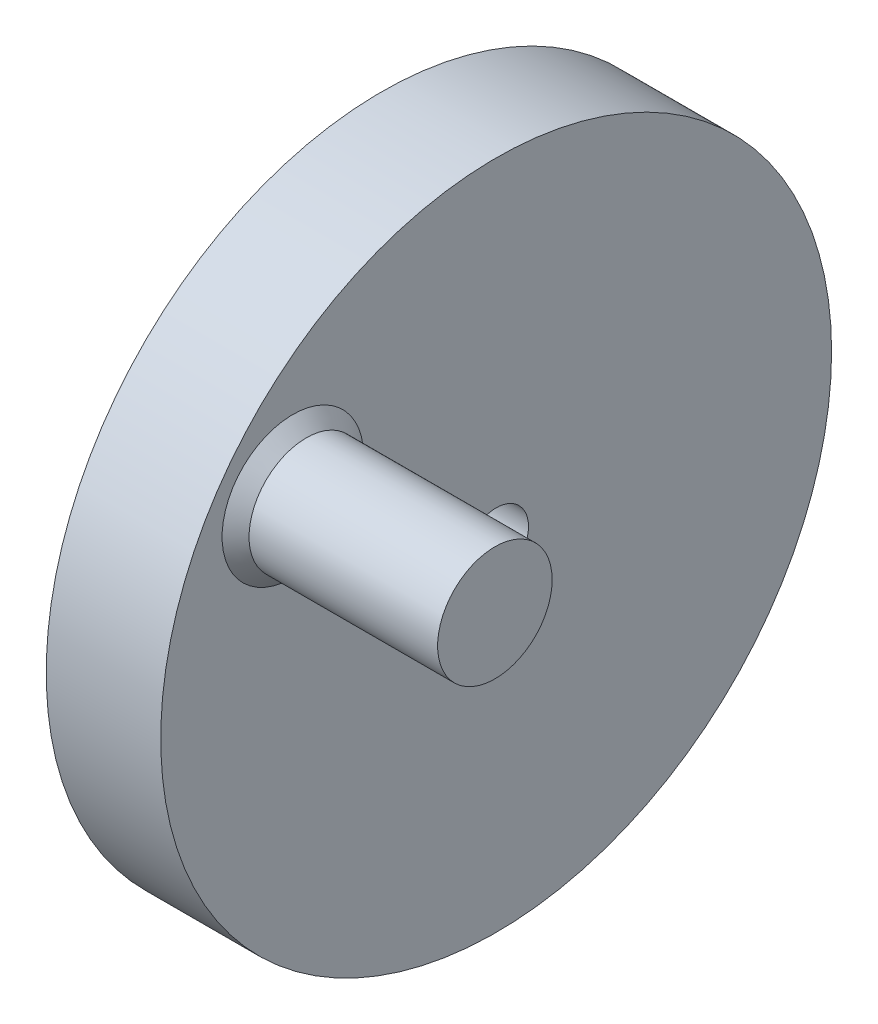
ISO-10303-21;
HEADER;
FILE_DESCRIPTION(('STEP AP214'),'2;1');
FILE_NAME('part.step','',(''),(''),'','','');
FILE_SCHEMA(('AUTOMOTIVE_DESIGN { 1 0 10303 214 1 1 1 1 }'));
ENDSEC;
DATA;
#1=APPLICATION_CONTEXT('core data for automotive mechanical design processes');
#2=APPLICATION_PROTOCOL_DEFINITION('international standard','automotive_design',2000,#1);
#3=PRODUCT_CONTEXT('',#1,'mechanical');
#4=PRODUCT('Part','Part','',(#3));
#5=PRODUCT_RELATED_PRODUCT_CATEGORY('part','',(#4));
#6=PRODUCT_DEFINITION_FORMATION('','',#4);
#7=PRODUCT_DEFINITION_CONTEXT('part definition',#1,'design');
#8=PRODUCT_DEFINITION('design','',#6,#7);
#9=PRODUCT_DEFINITION_SHAPE('','',#8);
#10=(LENGTH_UNIT() NAMED_UNIT(*) SI_UNIT(.MILLI.,.METRE.));
#11=(NAMED_UNIT(*) PLANE_ANGLE_UNIT() SI_UNIT($,.RADIAN.));
#12=(NAMED_UNIT(*) SI_UNIT($,.STERADIAN.) SOLID_ANGLE_UNIT());
#13=UNCERTAINTY_MEASURE_WITH_UNIT(LENGTH_MEASURE(1.E-05),#10,'distance_accuracy_value','');
#14=(GEOMETRIC_REPRESENTATION_CONTEXT(3) GLOBAL_UNCERTAINTY_ASSIGNED_CONTEXT((#13)) GLOBAL_UNIT_ASSIGNED_CONTEXT((#10,
#11,#12)) REPRESENTATION_CONTEXT('',''));
#15=CARTESIAN_POINT('',(0.,0.,0.));
#16=DIRECTION('',(0.,0.,1.));
#17=DIRECTION('',(1.,0.,0.));
#18=AXIS2_PLACEMENT_3D('',#15,#16,#17);
#19=CARTESIAN_POINT('',(8.5,0.,0.));
#20=DIRECTION('',(1.,0.,0.));
#21=DIRECTION('',(0.,0.,-1.));
#22=AXIS2_PLACEMENT_3D('',#19,#20,#21);
#23=PLANE('',#22);
#24=CARTESIAN_POINT('',(8.5,10.6969621414791,15.0938729603692));
#25=DIRECTION('',(1.,0.,0.));
#26=DIRECTION('',(0.,0.,-1.));
#27=AXIS2_PLACEMENT_3D('',#24,#25,#26);
#28=CIRCLE('',#27,5.25);
#29=CARTESIAN_POINT('',(8.5,10.6969621414791,9.84387296036918));
#30=VERTEX_POINT('',#29);
#31=EDGE_CURVE('E10',#30,#30,#28,.F.);
#32=ORIENTED_EDGE('',*,*,#31,.T.);
#33=EDGE_LOOP('',(#32));
#34=FACE_BOUND('',#33,.T.);
#35=CARTESIAN_POINT('',(8.5,0.,0.));
#36=DIRECTION('',(1.,0.,0.));
#37=DIRECTION('',(0.,0.,-1.));
#38=AXIS2_PLACEMENT_3D('',#35,#36,#37);
#39=CIRCLE('',#38,24.9);
#40=CARTESIAN_POINT('',(8.5,0.,-24.9));
#41=VERTEX_POINT('',#40);
#42=EDGE_CURVE('E42',#41,#41,#39,.T.);
#43=ORIENTED_EDGE('',*,*,#42,.T.);
#44=EDGE_LOOP('',(#43));
#45=FACE_BOUND('',#44,.T.);
#46=CARTESIAN_POINT('',(8.5,0.,0.));
#47=DIRECTION('',(1.,0.,0.));
#48=DIRECTION('',(0.,0.,-1.));
#49=AXIS2_PLACEMENT_3D('',#46,#47,#48);
#50=CIRCLE('',#49,2.4);
#51=CARTESIAN_POINT('',(8.5,0.,-2.4));
#52=VERTEX_POINT('',#51);
#53=EDGE_CURVE('E50',#52,#52,#50,.T.);
#54=ORIENTED_EDGE('',*,*,#53,.F.);
#55=EDGE_LOOP('',(#54));
#56=FACE_BOUND('',#55,.T.);
#57=ADVANCED_FACE('F31',(#34,#45,#56),#23,.T.);
#58=CARTESIAN_POINT('',(0.,0.,0.));
#59=DIRECTION('',(1.,0.,0.));
#60=DIRECTION('',(0.,0.,-1.));
#61=AXIS2_PLACEMENT_3D('',#58,#59,#60);
#62=PLANE('',#61);
#63=CARTESIAN_POINT('',(0.,0.,0.));
#64=DIRECTION('',(1.,0.,0.));
#65=DIRECTION('',(0.,0.,-1.));
#66=AXIS2_PLACEMENT_3D('',#63,#64,#65);
#67=CIRCLE('',#66,24.9);
#68=CARTESIAN_POINT('',(0.,0.,-24.9));
#69=VERTEX_POINT('',#68);
#70=EDGE_CURVE('E46',#69,#69,#67,.T.);
#71=ORIENTED_EDGE('',*,*,#70,.F.);
#72=EDGE_LOOP('',(#71));
#73=FACE_BOUND('',#72,.T.);
#74=CARTESIAN_POINT('',(0.,0.,0.));
#75=DIRECTION('',(1.,0.,0.));
#76=DIRECTION('',(0.,0.,-1.));
#77=AXIS2_PLACEMENT_3D('',#74,#75,#76);
#78=CIRCLE('',#77,2.4);
#79=CARTESIAN_POINT('',(0.,0.,-2.4));
#80=VERTEX_POINT('',#79);
#81=EDGE_CURVE('E52',#80,#80,#78,.T.);
#82=ORIENTED_EDGE('',*,*,#81,.T.);
#83=EDGE_LOOP('',(#82));
#84=FACE_BOUND('',#83,.T.);
#85=ADVANCED_FACE('F76',(#73,#84),#62,.F.);
#86=CARTESIAN_POINT('',(8.5,0.,0.));
#87=DIRECTION('',(-1.,0.,0.));
#88=DIRECTION('',(0.,0.,1.));
#89=AXIS2_PLACEMENT_3D('',#86,#87,#88);
#90=CYLINDRICAL_SURFACE('',#89,24.9);
#91=ORIENTED_EDGE('',*,*,#42,.F.);
#92=EDGE_LOOP('',(#91));
#93=FACE_BOUND('',#92,.T.);
#94=ORIENTED_EDGE('',*,*,#70,.T.);
#95=EDGE_LOOP('',(#94));
#96=FACE_BOUND('',#95,.T.);
#97=ADVANCED_FACE('F72',(#93,#96),#90,.T.);
#98=CARTESIAN_POINT('',(8.5,0.,0.));
#99=DIRECTION('',(-1.,0.,0.));
#100=DIRECTION('',(0.,0.,1.));
#101=AXIS2_PLACEMENT_3D('',#98,#99,#100);
#102=CYLINDRICAL_SURFACE('',#101,2.4);
#103=ORIENTED_EDGE('',*,*,#53,.T.);
#104=EDGE_LOOP('',(#103));
#105=FACE_BOUND('',#104,.T.);
#106=ORIENTED_EDGE('',*,*,#81,.F.);
#107=EDGE_LOOP('',(#106));
#108=FACE_BOUND('',#107,.T.);
#109=ADVANCED_FACE('F65',(#105,#108),#102,.F.);
#110=CARTESIAN_POINT('',(23.5,10.6969621414791,15.0938729603692));
#111=DIRECTION('',(-1.,0.,0.));
#112=DIRECTION('',(0.,0.,1.));
#113=AXIS2_PLACEMENT_3D('',#110,#111,#112);
#114=CYLINDRICAL_SURFACE('',#113,4.25);
#115=CARTESIAN_POINT('',(9.50000000000001,10.6969621414791,15.0938729603692));
#116=DIRECTION('',(1.,0.,0.));
#117=DIRECTION('',(0.,0.,-1.));
#118=AXIS2_PLACEMENT_3D('',#115,#116,#117);
#119=CIRCLE('',#118,4.25);
#120=CARTESIAN_POINT('',(9.50000000000001,10.6969621414791,10.8438729603692));
#121=VERTEX_POINT('',#120);
#122=EDGE_CURVE('E38',#121,#121,#119,.T.);
#123=ORIENTED_EDGE('',*,*,#122,.T.);
#124=EDGE_LOOP('',(#123));
#125=FACE_BOUND('',#124,.T.);
#126=CARTESIAN_POINT('',(23.5,10.6969621414791,15.0938729603692));
#127=DIRECTION('',(1.,0.,0.));
#128=DIRECTION('',(0.,0.,-1.));
#129=AXIS2_PLACEMENT_3D('',#126,#127,#128);
#130=CIRCLE('',#129,4.25);
#131=CARTESIAN_POINT('',(23.5,10.6969621414791,10.8438729603692));
#132=VERTEX_POINT('',#131);
#133=EDGE_CURVE('E55',#132,#132,#130,.T.);
#134=ORIENTED_EDGE('',*,*,#133,.F.);
#135=EDGE_LOOP('',(#134));
#136=FACE_BOUND('',#135,.T.);
#137=ADVANCED_FACE('F63',(#125,#136),#114,.T.);
#138=CARTESIAN_POINT('',(23.5,10.6969621414791,15.0938729603692));
#139=DIRECTION('',(1.,0.,0.));
#140=DIRECTION('',(0.,0.,-1.));
#141=AXIS2_PLACEMENT_3D('',#138,#139,#140);
#142=PLANE('',#141);
#143=ORIENTED_EDGE('',*,*,#133,.T.);
#144=EDGE_LOOP('',(#143));
#145=FACE_BOUND('',#144,.T.);
#146=ADVANCED_FACE('F61',(#145),#142,.T.);
#147=CARTESIAN_POINT('',(9.50000000000001,10.6969621414791,15.0938729603692));
#148=DIRECTION('',(-1.,0.,0.));
#149=DIRECTION('',(0.,0.,1.));
#150=AXIS2_PLACEMENT_3D('',#147,#148,#149);
#151=CONICAL_SURFACE('',#150,4.25,0.785398163397442);
#152=ORIENTED_EDGE('',*,*,#31,.F.);
#153=EDGE_LOOP('',(#152));
#154=FACE_BOUND('',#153,.T.);
#155=ORIENTED_EDGE('',*,*,#122,.F.);
#156=EDGE_LOOP('',(#155));
#157=FACE_BOUND('',#156,.T.);
#158=ADVANCED_FACE('F33',(#154,#157),#151,.T.);
#159=CLOSED_SHELL('',(#57,#85,#97,#109,#137,#146,#158));
#160=MANIFOLD_SOLID_BREP('B2',#159);
#161=ADVANCED_BREP_SHAPE_REPRESENTATION('',(#18,#160),#14);
#162=SHAPE_DEFINITION_REPRESENTATION(#9,#161);
ENDSEC;
END-ISO-10303-21;
